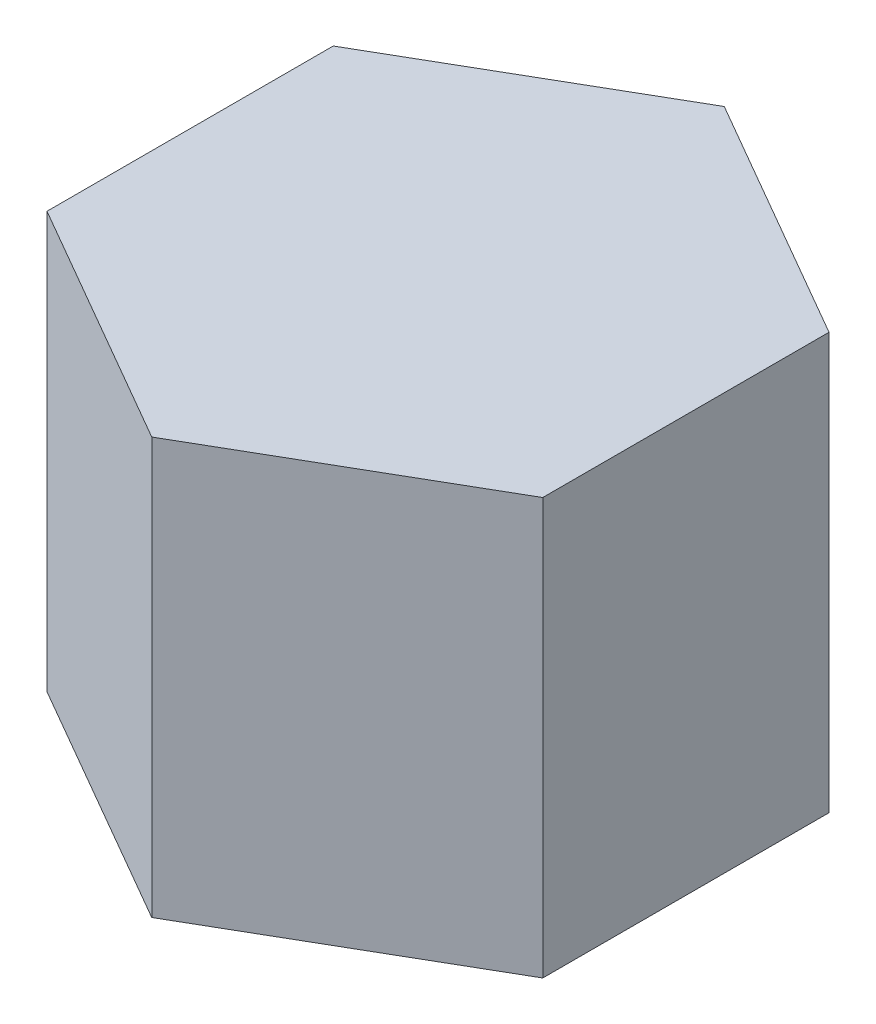
ISO-10303-21;
HEADER;
FILE_DESCRIPTION(('STEP AP214'),'2;1');
FILE_NAME('part.step','',(''),(''),'','','');
FILE_SCHEMA(('AUTOMOTIVE_DESIGN { 1 0 10303 214 1 1 1 1 }'));
ENDSEC;
DATA;
#1=APPLICATION_CONTEXT('core data for automotive mechanical design processes');
#2=APPLICATION_PROTOCOL_DEFINITION('international standard','automotive_design',2000,#1);
#3=PRODUCT_CONTEXT('',#1,'mechanical');
#4=PRODUCT('Part','Part','',(#3));
#5=PRODUCT_RELATED_PRODUCT_CATEGORY('part','',(#4));
#6=PRODUCT_DEFINITION_FORMATION('','',#4);
#7=PRODUCT_DEFINITION_CONTEXT('part definition',#1,'design');
#8=PRODUCT_DEFINITION('design','',#6,#7);
#9=PRODUCT_DEFINITION_SHAPE('','',#8);
#10=(LENGTH_UNIT() NAMED_UNIT(*) SI_UNIT(.MILLI.,.METRE.));
#11=(NAMED_UNIT(*) PLANE_ANGLE_UNIT() SI_UNIT($,.RADIAN.));
#12=(NAMED_UNIT(*) SI_UNIT($,.STERADIAN.) SOLID_ANGLE_UNIT());
#13=UNCERTAINTY_MEASURE_WITH_UNIT(LENGTH_MEASURE(1.E-05),#10,'distance_accuracy_value','');
#14=(GEOMETRIC_REPRESENTATION_CONTEXT(3) GLOBAL_UNCERTAINTY_ASSIGNED_CONTEXT((#13)) GLOBAL_UNIT_ASSIGNED_CONTEXT((#10,
#11,#12)) REPRESENTATION_CONTEXT('',''));
#15=CARTESIAN_POINT('',(0.,0.,0.));
#16=DIRECTION('',(0.,0.,1.));
#17=DIRECTION('',(1.,0.,0.));
#18=AXIS2_PLACEMENT_3D('',#15,#16,#17);
#19=CARTESIAN_POINT('',(205.839551417382,-147.556598747966,290.81594581671));
#20=DIRECTION('',(-0.500000000000096,0.,-0.866025403784383));
#21=DIRECTION('',(-0.866025403784383,0.,0.500000000000096));
#22=AXIS2_PLACEMENT_3D('',#19,#20,#21);
#23=PLANE('',#22);
#24=CARTESIAN_POINT('',(206.142660308706,-147.047793579175,290.64094581671));
#25=DIRECTION('',(-0.866025403784383,0.,0.500000000000096));
#26=VECTOR('',#25,1.);
#27=LINE('',#24,#26);
#28=CARTESIAN_POINT('',(206.142660308706,-147.047793579175,290.64094581671));
#29=VERTEX_POINT('',#28);
#30=CARTESIAN_POINT('',(205.839551417382,-147.047793579175,290.81594581671));
#31=VERTEX_POINT('',#30);
#32=EDGE_CURVE('E170',#29,#31,#27,.T.);
#33=ORIENTED_EDGE('',*,*,#32,.T.);
#34=CARTESIAN_POINT('',(205.839551417382,-147.556598747966,290.81594581671));
#35=DIRECTION('',(0.,1.,0.));
#36=VECTOR('',#35,1.);
#37=LINE('',#34,#36);
#38=CARTESIAN_POINT('',(205.839551417382,-147.556598747966,290.81594581671));
#39=VERTEX_POINT('',#38);
#40=EDGE_CURVE('E35',#39,#31,#37,.T.);
#41=ORIENTED_EDGE('',*,*,#40,.F.);
#42=CARTESIAN_POINT('',(206.142660308706,-147.556598747966,290.64094581671));
#43=DIRECTION('',(-0.866025403784383,0.,0.500000000000096));
#44=VECTOR('',#43,1.);
#45=LINE('',#42,#44);
#46=CARTESIAN_POINT('',(206.142660308706,-147.556598747966,290.64094581671));
#47=VERTEX_POINT('',#46);
#48=EDGE_CURVE('E159',#47,#39,#45,.T.);
#49=ORIENTED_EDGE('',*,*,#48,.F.);
#50=CARTESIAN_POINT('',(206.142660308706,-147.556598747966,290.64094581671));
#51=DIRECTION('',(0.,1.,0.));
#52=VECTOR('',#51,1.);
#53=LINE('',#50,#52);
#54=EDGE_CURVE('E10',#47,#29,#53,.T.);
#55=ORIENTED_EDGE('',*,*,#54,.T.);
#56=EDGE_LOOP('',(#33,#41,#49,#55));
#57=FACE_BOUND('',#56,.T.);
#58=ADVANCED_FACE('F16',(#57),#23,.F.);
#59=CARTESIAN_POINT('',(206.142660308706,-147.556598747966,291.594471220494));
#60=DIRECTION('',(-1.,0.,0.));
#61=DIRECTION('',(0.,-1.,0.));
#62=AXIS2_PLACEMENT_3D('',#59,#60,#61);
#63=PLANE('',#62);
#64=CARTESIAN_POINT('',(206.142660308706,-147.047793579175,290.29094581671));
#65=DIRECTION('',(0.,0.,1.));
#66=VECTOR('',#65,1.);
#67=LINE('',#64,#66);
#68=CARTESIAN_POINT('',(206.142660308706,-147.047793579175,290.29094581671));
#69=VERTEX_POINT('',#68);
#70=EDGE_CURVE('E167',#69,#29,#67,.T.);
#71=ORIENTED_EDGE('',*,*,#70,.T.);
#72=ORIENTED_EDGE('',*,*,#54,.F.);
#73=CARTESIAN_POINT('',(206.142660308706,-147.556598747966,290.29094581671));
#74=DIRECTION('',(0.,0.,1.));
#75=VECTOR('',#74,1.);
#76=LINE('',#73,#75);
#77=CARTESIAN_POINT('',(206.142660308706,-147.556598747966,290.29094581671));
#78=VERTEX_POINT('',#77);
#79=EDGE_CURVE('E156',#78,#47,#76,.T.);
#80=ORIENTED_EDGE('',*,*,#79,.F.);
#81=CARTESIAN_POINT('',(206.142660308706,-147.556598747966,290.29094581671));
#82=DIRECTION('',(0.,1.,0.));
#83=VECTOR('',#82,1.);
#84=LINE('',#81,#83);
#85=EDGE_CURVE('E27',#78,#69,#84,.T.);
#86=ORIENTED_EDGE('',*,*,#85,.T.);
#87=EDGE_LOOP('',(#71,#72,#80,#86));
#88=FACE_BOUND('',#87,.T.);
#89=ADVANCED_FACE('F189',(#88),#63,.F.);
#90=CARTESIAN_POINT('',(206.142660308706,-147.556598747966,290.29094581671));
#91=DIRECTION('',(-0.499999999999943,0.,0.866025403784471));
#92=DIRECTION('',(0.866025403784471,0.,0.499999999999943));
#93=AXIS2_PLACEMENT_3D('',#90,#91,#92);
#94=PLANE('',#93);
#95=CARTESIAN_POINT('',(205.839551417382,-147.047793579175,290.11594581671));
#96=DIRECTION('',(0.866025403784471,0.,0.499999999999943));
#97=VECTOR('',#96,1.);
#98=LINE('',#95,#97);
#99=CARTESIAN_POINT('',(205.839551417382,-147.047793579175,290.11594581671));
#100=VERTEX_POINT('',#99);
#101=EDGE_CURVE('E163',#100,#69,#98,.T.);
#102=ORIENTED_EDGE('',*,*,#101,.T.);
#103=ORIENTED_EDGE('',*,*,#85,.F.);
#104=CARTESIAN_POINT('',(205.839551417382,-147.556598747966,290.11594581671));
#105=DIRECTION('',(0.866025403784471,0.,0.499999999999943));
#106=VECTOR('',#105,1.);
#107=LINE('',#104,#106);
#108=CARTESIAN_POINT('',(205.839551417382,-147.556598747966,290.11594581671));
#109=VERTEX_POINT('',#108);
#110=EDGE_CURVE('E106',#109,#78,#107,.T.);
#111=ORIENTED_EDGE('',*,*,#110,.F.);
#112=CARTESIAN_POINT('',(205.839551417381,-147.556598747966,290.11594581671));
#113=DIRECTION('',(0.,1.,0.));
#114=VECTOR('',#113,1.);
#115=LINE('',#112,#114);
#116=EDGE_CURVE('E94',#109,#100,#115,.T.);
#117=ORIENTED_EDGE('',*,*,#116,.T.);
#118=EDGE_LOOP('',(#102,#103,#111,#117));
#119=FACE_BOUND('',#118,.T.);
#120=ADVANCED_FACE('F198',(#119),#94,.F.);
#121=CARTESIAN_POINT('',(205.839551417382,-147.556598747966,290.11594581671));
#122=DIRECTION('',(0.499999999999943,0.,0.866025403784471));
#123=DIRECTION('',(0.866025403784471,0.,-0.499999999999943));
#124=AXIS2_PLACEMENT_3D('',#121,#122,#123);
#125=PLANE('',#124);
#126=CARTESIAN_POINT('',(205.536442526057,-147.047793579175,290.29094581671));
#127=DIRECTION('',(0.866025403784471,0.,-0.499999999999943));
#128=VECTOR('',#127,1.);
#129=LINE('',#126,#128);
#130=CARTESIAN_POINT('',(205.536442526057,-147.047793579175,290.29094581671));
#131=VERTEX_POINT('',#130);
#132=EDGE_CURVE('E162',#131,#100,#129,.T.);
#133=ORIENTED_EDGE('',*,*,#132,.T.);
#134=ORIENTED_EDGE('',*,*,#116,.F.);
#135=CARTESIAN_POINT('',(205.536442526057,-147.556598747966,290.29094581671));
#136=DIRECTION('',(0.866025403784471,0.,-0.499999999999943));
#137=VECTOR('',#136,1.);
#138=LINE('',#135,#137);
#139=CARTESIAN_POINT('',(205.536442526057,-147.556598747966,290.29094581671));
#140=VERTEX_POINT('',#139);
#141=EDGE_CURVE('E98',#140,#109,#138,.T.);
#142=ORIENTED_EDGE('',*,*,#141,.F.);
#143=CARTESIAN_POINT('',(205.536442526057,-147.556598747966,290.29094581671));
#144=DIRECTION('',(0.,1.,0.));
#145=VECTOR('',#144,1.);
#146=LINE('',#143,#145);
#147=EDGE_CURVE('E79',#140,#131,#146,.T.);
#148=ORIENTED_EDGE('',*,*,#147,.T.);
#149=EDGE_LOOP('',(#133,#134,#142,#148));
#150=FACE_BOUND('',#149,.T.);
#151=ADVANCED_FACE('F100',(#150),#125,.F.);
#152=CARTESIAN_POINT('',(205.536442526057,-147.556598747966,291.594471220494));
#153=DIRECTION('',(1.,0.,0.));
#154=DIRECTION('',(0.,1.,0.));
#155=AXIS2_PLACEMENT_3D('',#152,#153,#154);
#156=PLANE('',#155);
#157=CARTESIAN_POINT('',(205.536442526057,-147.047793579175,290.64094581671));
#158=DIRECTION('',(0.,0.,-1.));
#159=VECTOR('',#158,1.);
#160=LINE('',#157,#159);
#161=CARTESIAN_POINT('',(205.536442526057,-147.047793579175,290.64094581671));
#162=VERTEX_POINT('',#161);
#163=EDGE_CURVE('E88',#162,#131,#160,.T.);
#164=ORIENTED_EDGE('',*,*,#163,.T.);
#165=ORIENTED_EDGE('',*,*,#147,.F.);
#166=CARTESIAN_POINT('',(205.536442526057,-147.556598747966,290.64094581671));
#167=DIRECTION('',(0.,0.,-1.));
#168=VECTOR('',#167,1.);
#169=LINE('',#166,#168);
#170=CARTESIAN_POINT('',(205.536442526057,-147.556598747966,290.64094581671));
#171=VERTEX_POINT('',#170);
#172=EDGE_CURVE('E84',#171,#140,#169,.T.);
#173=ORIENTED_EDGE('',*,*,#172,.F.);
#174=CARTESIAN_POINT('',(205.536442526057,-147.556598747966,290.64094581671));
#175=DIRECTION('',(0.,1.,0.));
#176=VECTOR('',#175,1.);
#177=LINE('',#174,#176);
#178=EDGE_CURVE('E58',#171,#162,#177,.T.);
#179=ORIENTED_EDGE('',*,*,#178,.T.);
#180=EDGE_LOOP('',(#164,#165,#173,#179));
#181=FACE_BOUND('',#180,.T.);
#182=ADVANCED_FACE('F82',(#181),#156,.F.);
#183=CARTESIAN_POINT('',(205.536442526057,-147.556598747966,290.64094581671));
#184=DIRECTION('',(0.500000000000062,0.,-0.866025403784403));
#185=DIRECTION('',(-0.866025403784403,0.,-0.500000000000062));
#186=AXIS2_PLACEMENT_3D('',#183,#184,#185);
#187=PLANE('',#186);
#188=CARTESIAN_POINT('',(205.839551417382,-147.047793579175,290.81594581671));
#189=DIRECTION('',(-0.866025403784403,0.,-0.500000000000062));
#190=VECTOR('',#189,1.);
#191=LINE('',#188,#190);
#192=EDGE_CURVE('E160',#31,#162,#191,.T.);
#193=ORIENTED_EDGE('',*,*,#192,.T.);
#194=ORIENTED_EDGE('',*,*,#178,.F.);
#195=CARTESIAN_POINT('',(205.839551417382,-147.556598747966,290.81594581671));
#196=DIRECTION('',(-0.866025403784403,0.,-0.500000000000062));
#197=VECTOR('',#196,1.);
#198=LINE('',#195,#197);
#199=EDGE_CURVE('E112',#39,#171,#198,.T.);
#200=ORIENTED_EDGE('',*,*,#199,.F.);
#201=ORIENTED_EDGE('',*,*,#40,.T.);
#202=EDGE_LOOP('',(#193,#194,#200,#201));
#203=FACE_BOUND('',#202,.T.);
#204=ADVANCED_FACE('F131',(#203),#187,.F.);
#205=CARTESIAN_POINT('',(206.491105863044,-147.556598747966,291.594471220494));
#206=DIRECTION('',(0.,1.,0.));
#207=DIRECTION('',(-1.,0.,0.));
#208=AXIS2_PLACEMENT_3D('',#205,#206,#207);
#209=PLANE('',#208);
#210=ORIENTED_EDGE('',*,*,#48,.T.);
#211=ORIENTED_EDGE('',*,*,#199,.T.);
#212=ORIENTED_EDGE('',*,*,#172,.T.);
#213=ORIENTED_EDGE('',*,*,#141,.T.);
#214=ORIENTED_EDGE('',*,*,#110,.T.);
#215=ORIENTED_EDGE('',*,*,#79,.T.);
#216=EDGE_LOOP('',(#210,#211,#212,#213,#214,#215));
#217=FACE_BOUND('',#216,.T.);
#218=ADVANCED_FACE('F111',(#217),#209,.F.);
#219=CARTESIAN_POINT('',(206.491105863044,-147.047793579175,291.594471220494));
#220=DIRECTION('',(0.,1.,0.));
#221=DIRECTION('',(-1.,0.,0.));
#222=AXIS2_PLACEMENT_3D('',#219,#220,#221);
#223=PLANE('',#222);
#224=ORIENTED_EDGE('',*,*,#32,.F.);
#225=ORIENTED_EDGE('',*,*,#70,.F.);
#226=ORIENTED_EDGE('',*,*,#101,.F.);
#227=ORIENTED_EDGE('',*,*,#132,.F.);
#228=ORIENTED_EDGE('',*,*,#163,.F.);
#229=ORIENTED_EDGE('',*,*,#192,.F.);
#230=EDGE_LOOP('',(#224,#225,#226,#227,#228,#229));
#231=FACE_BOUND('',#230,.T.);
#232=ADVANCED_FACE('F130',(#231),#223,.T.);
#233=CLOSED_SHELL('',(#58,#89,#120,#151,#182,#204,#218,#232));
#234=MANIFOLD_SOLID_BREP('B1',#233);
#235=ADVANCED_BREP_SHAPE_REPRESENTATION('',(#18,#234),#14);
#236=SHAPE_DEFINITION_REPRESENTATION(#9,#235);
ENDSEC;
END-ISO-10303-21;
